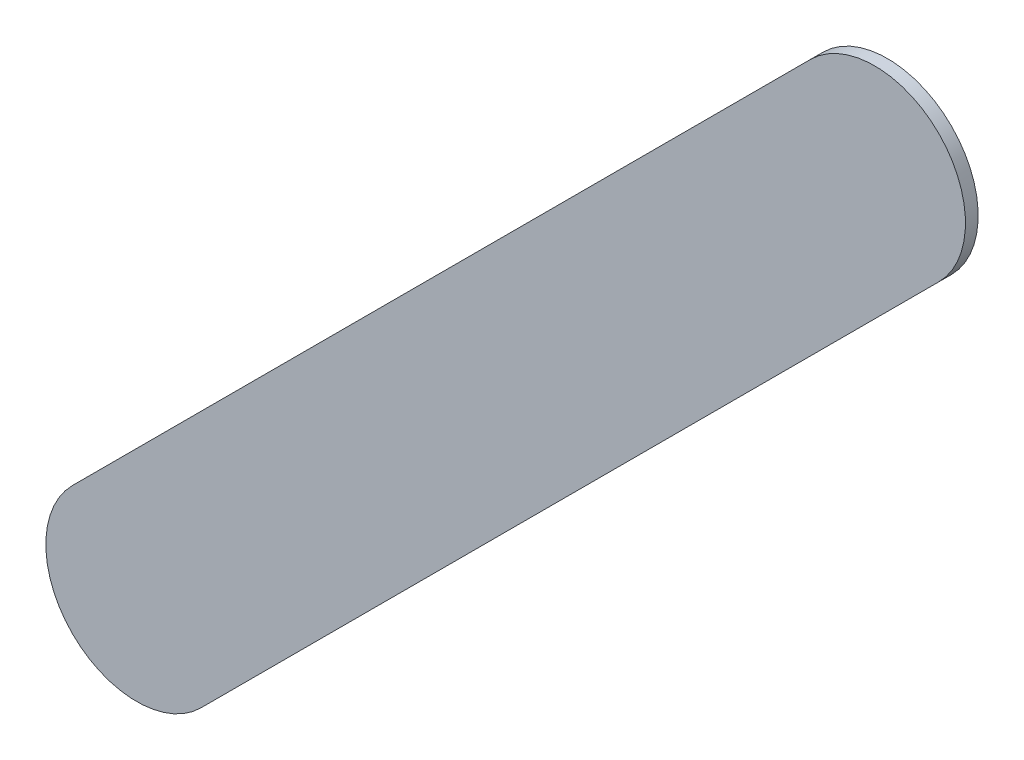
ISO-10303-21;
HEADER;
FILE_DESCRIPTION(('STEP AP214'),'2;1');
FILE_NAME('part.step','',(''),(''),'','','');
FILE_SCHEMA(('AUTOMOTIVE_DESIGN { 1 0 10303 214 1 1 1 1 }'));
ENDSEC;
DATA;
#1=APPLICATION_CONTEXT('core data for automotive mechanical design processes');
#2=APPLICATION_PROTOCOL_DEFINITION('international standard','automotive_design',2000,#1);
#3=PRODUCT_CONTEXT('',#1,'mechanical');
#4=PRODUCT('Part','Part','',(#3));
#5=PRODUCT_RELATED_PRODUCT_CATEGORY('part','',(#4));
#6=PRODUCT_DEFINITION_FORMATION('','',#4);
#7=PRODUCT_DEFINITION_CONTEXT('part definition',#1,'design');
#8=PRODUCT_DEFINITION('design','',#6,#7);
#9=PRODUCT_DEFINITION_SHAPE('','',#8);
#10=(LENGTH_UNIT() NAMED_UNIT(*) SI_UNIT(.MILLI.,.METRE.));
#11=(NAMED_UNIT(*) PLANE_ANGLE_UNIT() SI_UNIT($,.RADIAN.));
#12=(NAMED_UNIT(*) SI_UNIT($,.STERADIAN.) SOLID_ANGLE_UNIT());
#13=UNCERTAINTY_MEASURE_WITH_UNIT(LENGTH_MEASURE(1.E-05),#10,'distance_accuracy_value','');
#14=(GEOMETRIC_REPRESENTATION_CONTEXT(3) GLOBAL_UNCERTAINTY_ASSIGNED_CONTEXT((#13)) GLOBAL_UNIT_ASSIGNED_CONTEXT((#10,
#11,#12)) REPRESENTATION_CONTEXT('',''));
#15=CARTESIAN_POINT('',(0.,0.,0.));
#16=DIRECTION('',(0.,0.,1.));
#17=DIRECTION('',(1.,0.,0.));
#18=AXIS2_PLACEMENT_3D('',#15,#16,#17);
#19=CARTESIAN_POINT('',(128.855223,-76.023223,0.));
#20=DIRECTION('',(0.,0.,1.));
#21=DIRECTION('',(1.,0.,0.));
#22=AXIS2_PLACEMENT_3D('',#19,#20,#21);
#23=PLANE('',#22);
#24=DIRECTION('',(-0.707106781186548,-0.707106781186548,0.));
#25=VECTOR('',#24,1.);
#26=CARTESIAN_POINT('',(128.855223,-76.023223,0.));
#27=LINE('',#26,#25);
#28=CARTESIAN_POINT('',(128.855223,-76.023223,0.));
#29=VERTEX_POINT('',#28);
#30=CARTESIAN_POINT('',(126.823223,-78.055223,0.));
#31=VERTEX_POINT('',#30);
#32=EDGE_CURVE('E82',#29,#31,#27,.T.);
#33=ORIENTED_EDGE('',*,*,#32,.T.);
#34=CARTESIAN_POINT('',(126.9999995,-78.2319995,0.));
#35=DIRECTION('',(0.,0.,1.));
#36=DIRECTION('',(-0.707106781186548,0.707106781186548,0.));
#37=AXIS2_PLACEMENT_3D('',#34,#35,#36);
#38=CIRCLE('',#37,0.249999723809);
#39=CARTESIAN_POINT('',(127.176776,-78.408776,0.));
#40=VERTEX_POINT('',#39);
#41=EDGE_CURVE('E109',#31,#40,#38,.T.);
#42=ORIENTED_EDGE('',*,*,#41,.T.);
#43=DIRECTION('',(0.707106781186548,0.707106781186548,0.));
#44=VECTOR('',#43,1.);
#45=CARTESIAN_POINT('',(127.176776,-78.408776,0.));
#46=LINE('',#45,#44);
#47=CARTESIAN_POINT('',(129.208776,-76.376776,0.));
#48=VERTEX_POINT('',#47);
#49=EDGE_CURVE('E74',#40,#48,#46,.T.);
#50=ORIENTED_EDGE('',*,*,#49,.T.);
#51=CARTESIAN_POINT('',(129.0319995,-76.1999995,0.));
#52=DIRECTION('',(0.,0.,1.));
#53=DIRECTION('',(0.707106781186548,-0.707106781186548,0.));
#54=AXIS2_PLACEMENT_3D('',#51,#52,#53);
#55=CIRCLE('',#54,0.249999723809);
#56=EDGE_CURVE('E11',#48,#29,#55,.T.);
#57=ORIENTED_EDGE('',*,*,#56,.T.);
#58=EDGE_LOOP('',(#33,#42,#50,#57));
#59=FACE_BOUND('',#58,.T.);
#60=ADVANCED_FACE('F17',(#59),#23,.T.);
#61=CARTESIAN_POINT('',(128.855223,-76.023223,-0.035));
#62=DIRECTION('',(0.,0.,1.));
#63=DIRECTION('',(1.,0.,0.));
#64=AXIS2_PLACEMENT_3D('',#61,#62,#63);
#65=PLANE('',#64);
#66=CARTESIAN_POINT('',(129.0319995,-76.1999995,-0.035));
#67=DIRECTION('',(0.,0.,1.));
#68=DIRECTION('',(0.707106781186548,-0.707106781186548,0.));
#69=AXIS2_PLACEMENT_3D('',#66,#67,#68);
#70=CIRCLE('',#69,0.249999723809);
#71=CARTESIAN_POINT('',(129.208776,-76.376776,-0.035));
#72=VERTEX_POINT('',#71);
#73=CARTESIAN_POINT('',(128.855223,-76.023223,-0.035));
#74=VERTEX_POINT('',#73);
#75=EDGE_CURVE('E25',#72,#74,#70,.T.);
#76=ORIENTED_EDGE('',*,*,#75,.F.);
#77=DIRECTION('',(0.707106781186548,0.707106781186548,0.));
#78=VECTOR('',#77,1.);
#79=CARTESIAN_POINT('',(127.176776,-78.408776,-0.035));
#80=LINE('',#79,#78);
#81=CARTESIAN_POINT('',(127.176776,-78.408776,-0.035));
#82=VERTEX_POINT('',#81);
#83=EDGE_CURVE('E101',#82,#72,#80,.T.);
#84=ORIENTED_EDGE('',*,*,#83,.F.);
#85=CARTESIAN_POINT('',(126.9999995,-78.2319995,-0.035));
#86=DIRECTION('',(0.,0.,1.));
#87=DIRECTION('',(-0.707106781186548,0.707106781186548,0.));
#88=AXIS2_PLACEMENT_3D('',#85,#86,#87);
#89=CIRCLE('',#88,0.249999723809);
#90=CARTESIAN_POINT('',(126.823223,-78.055223,-0.035));
#91=VERTEX_POINT('',#90);
#92=EDGE_CURVE('E84',#91,#82,#89,.T.);
#93=ORIENTED_EDGE('',*,*,#92,.F.);
#94=DIRECTION('',(-0.707106781186548,-0.707106781186548,0.));
#95=VECTOR('',#94,1.);
#96=CARTESIAN_POINT('',(128.855223,-76.023223,-0.035));
#97=LINE('',#96,#95);
#98=EDGE_CURVE('E80',#74,#91,#97,.T.);
#99=ORIENTED_EDGE('',*,*,#98,.F.);
#100=EDGE_LOOP('',(#76,#84,#93,#99));
#101=FACE_BOUND('',#100,.T.);
#102=ADVANCED_FACE('F86',(#101),#65,.F.);
#103=CARTESIAN_POINT('',(129.0319995,-76.1999995,-0.035));
#104=DIRECTION('',(0.,0.,-1.));
#105=DIRECTION('',(0.707106781186548,-0.707106781186548,0.));
#106=AXIS2_PLACEMENT_3D('',#103,#104,#105);
#107=CYLINDRICAL_SURFACE('',#106,0.249999723809);
#108=ORIENTED_EDGE('',*,*,#75,.T.);
#109=DIRECTION('',(0.,0.,1.));
#110=VECTOR('',#109,1.);
#111=CARTESIAN_POINT('',(128.855223,-76.023223,-0.035));
#112=LINE('',#111,#110);
#113=EDGE_CURVE('E68',#74,#29,#112,.T.);
#114=ORIENTED_EDGE('',*,*,#113,.T.);
#115=ORIENTED_EDGE('',*,*,#56,.F.);
#116=DIRECTION('',(0.,0.,1.));
#117=VECTOR('',#116,1.);
#118=CARTESIAN_POINT('',(129.208776,-76.376776,-0.035));
#119=LINE('',#118,#117);
#120=EDGE_CURVE('E71',#72,#48,#119,.T.);
#121=ORIENTED_EDGE('',*,*,#120,.F.);
#122=EDGE_LOOP('',(#108,#114,#115,#121));
#123=FACE_BOUND('',#122,.T.);
#124=ADVANCED_FACE('F67',(#123),#107,.T.);
#125=CARTESIAN_POINT('',(127.176776,-78.408776,-0.035));
#126=DIRECTION('',(-0.707106781186548,0.707106781186548,0.));
#127=DIRECTION('',(0.,0.,1.));
#128=AXIS2_PLACEMENT_3D('',#125,#126,#127);
#129=PLANE('',#128);
#130=ORIENTED_EDGE('',*,*,#83,.T.);
#131=ORIENTED_EDGE('',*,*,#120,.T.);
#132=ORIENTED_EDGE('',*,*,#49,.F.);
#133=DIRECTION('',(0.,0.,1.));
#134=VECTOR('',#133,1.);
#135=CARTESIAN_POINT('',(127.176776,-78.408776,-0.035));
#136=LINE('',#135,#134);
#137=EDGE_CURVE('E105',#82,#40,#136,.T.);
#138=ORIENTED_EDGE('',*,*,#137,.F.);
#139=EDGE_LOOP('',(#130,#131,#132,#138));
#140=FACE_BOUND('',#139,.T.);
#141=ADVANCED_FACE('F120',(#140),#129,.F.);
#142=CARTESIAN_POINT('',(126.9999995,-78.2319995,-0.035));
#143=DIRECTION('',(0.,0.,-1.));
#144=DIRECTION('',(-0.707106781186548,0.707106781186548,0.));
#145=AXIS2_PLACEMENT_3D('',#142,#143,#144);
#146=CYLINDRICAL_SURFACE('',#145,0.249999723809);
#147=ORIENTED_EDGE('',*,*,#92,.T.);
#148=ORIENTED_EDGE('',*,*,#137,.T.);
#149=ORIENTED_EDGE('',*,*,#41,.F.);
#150=DIRECTION('',(0.,0.,1.));
#151=VECTOR('',#150,1.);
#152=CARTESIAN_POINT('',(126.823223,-78.055223,-0.035));
#153=LINE('',#152,#151);
#154=EDGE_CURVE('E90',#91,#31,#153,.T.);
#155=ORIENTED_EDGE('',*,*,#154,.F.);
#156=EDGE_LOOP('',(#147,#148,#149,#155));
#157=FACE_BOUND('',#156,.T.);
#158=ADVANCED_FACE('F122',(#157),#146,.T.);
#159=CARTESIAN_POINT('',(128.855223,-76.023223,-0.035));
#160=DIRECTION('',(0.707106781186548,-0.707106781186548,0.));
#161=DIRECTION('',(0.,0.,-1.));
#162=AXIS2_PLACEMENT_3D('',#159,#160,#161);
#163=PLANE('',#162);
#164=ORIENTED_EDGE('',*,*,#98,.T.);
#165=ORIENTED_EDGE('',*,*,#154,.T.);
#166=ORIENTED_EDGE('',*,*,#32,.F.);
#167=ORIENTED_EDGE('',*,*,#113,.F.);
#168=EDGE_LOOP('',(#164,#165,#166,#167));
#169=FACE_BOUND('',#168,.T.);
#170=ADVANCED_FACE('F78',(#169),#163,.F.);
#171=CLOSED_SHELL('',(#60,#102,#124,#141,#158,#170));
#172=MANIFOLD_SOLID_BREP('B1',#171);
#173=ADVANCED_BREP_SHAPE_REPRESENTATION('',(#18,#172),#14);
#174=SHAPE_DEFINITION_REPRESENTATION(#9,#173);
ENDSEC;
END-ISO-10303-21;
